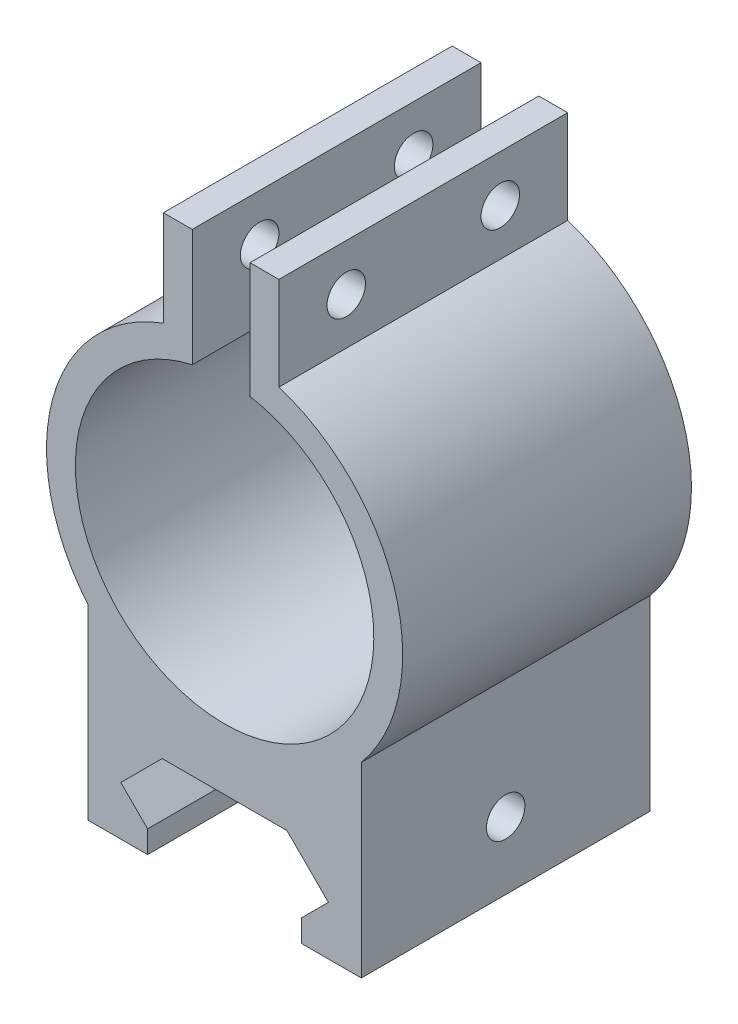
ISO-10303-21;
HEADER;
FILE_DESCRIPTION(('STEP AP214'),'2;1');
FILE_NAME('part.step','',(''),(''),'','','');
FILE_SCHEMA(('AUTOMOTIVE_DESIGN { 1 0 10303 214 1 1 1 1 }'));
ENDSEC;
DATA;
#1=APPLICATION_CONTEXT('core data for automotive mechanical design processes');
#2=APPLICATION_PROTOCOL_DEFINITION('international standard','automotive_design',2000,#1);
#3=PRODUCT_CONTEXT('',#1,'mechanical');
#4=PRODUCT('Part','Part','',(#3));
#5=PRODUCT_RELATED_PRODUCT_CATEGORY('part','',(#4));
#6=PRODUCT_DEFINITION_FORMATION('','',#4);
#7=PRODUCT_DEFINITION_CONTEXT('part definition',#1,'design');
#8=PRODUCT_DEFINITION('design','',#6,#7);
#9=PRODUCT_DEFINITION_SHAPE('','',#8);
#10=(LENGTH_UNIT() NAMED_UNIT(*) SI_UNIT(.MILLI.,.METRE.));
#11=(NAMED_UNIT(*) PLANE_ANGLE_UNIT() SI_UNIT($,.RADIAN.));
#12=(NAMED_UNIT(*) SI_UNIT($,.STERADIAN.) SOLID_ANGLE_UNIT());
#13=UNCERTAINTY_MEASURE_WITH_UNIT(LENGTH_MEASURE(1.E-05),#10,'distance_accuracy_value','');
#14=(GEOMETRIC_REPRESENTATION_CONTEXT(3) GLOBAL_UNCERTAINTY_ASSIGNED_CONTEXT((#13)) GLOBAL_UNIT_ASSIGNED_CONTEXT((#10,
#11,#12)) REPRESENTATION_CONTEXT('',''));
#15=CARTESIAN_POINT('',(0.,0.,0.));
#16=DIRECTION('',(0.,0.,1.));
#17=DIRECTION('',(1.,0.,0.));
#18=AXIS2_PLACEMENT_3D('',#15,#16,#17);
#19=CARTESIAN_POINT('',(-3.35941272408374,61.069189213308,30.));
#20=DIRECTION('',(0.,-1.,0.));
#21=DIRECTION('',(0.,0.,-1.));
#22=AXIS2_PLACEMENT_3D('',#19,#20,#21);
#23=PLANE('',#22);
#24=DIRECTION('',(-1.,0.,0.));
#25=VECTOR('',#24,1.);
#26=CARTESIAN_POINT('',(-3.35941272408374,61.069189213308,0.));
#27=LINE('',#26,#25);
#28=CARTESIAN_POINT('',(-3.35941272408374,61.069189213308,0.));
#29=VERTEX_POINT('',#28);
#30=CARTESIAN_POINT('',(-6.35941272408374,61.069189213308,0.));
#31=VERTEX_POINT('',#30);
#32=EDGE_CURVE('E255',#29,#31,#27,.T.);
#33=ORIENTED_EDGE('',*,*,#32,.T.);
#34=DIRECTION('',(0.,0.,-1.));
#35=VECTOR('',#34,1.);
#36=CARTESIAN_POINT('',(-6.35941272408374,61.069189213308,30.));
#37=LINE('',#36,#35);
#38=CARTESIAN_POINT('',(-6.35941272408374,61.069189213308,30.));
#39=VERTEX_POINT('',#38);
#40=EDGE_CURVE('E44',#39,#31,#37,.T.);
#41=ORIENTED_EDGE('',*,*,#40,.F.);
#42=DIRECTION('',(-1.,0.,0.));
#43=VECTOR('',#42,1.);
#44=CARTESIAN_POINT('',(-3.35941272408374,61.069189213308,30.));
#45=LINE('',#44,#43);
#46=CARTESIAN_POINT('',(-3.35941272408374,61.069189213308,30.));
#47=VERTEX_POINT('',#46);
#48=EDGE_CURVE('E259',#47,#39,#45,.T.);
#49=ORIENTED_EDGE('',*,*,#48,.F.);
#50=DIRECTION('',(0.,0.,-1.));
#51=VECTOR('',#50,1.);
#52=CARTESIAN_POINT('',(-3.35941272408374,61.069189213308,30.));
#53=LINE('',#52,#51);
#54=EDGE_CURVE('E11',#47,#29,#53,.T.);
#55=ORIENTED_EDGE('',*,*,#54,.T.);
#56=EDGE_LOOP('',(#33,#41,#49,#55));
#57=FACE_BOUND('',#56,.T.);
#58=ADVANCED_FACE('F36',(#57),#23,.F.);
#59=CARTESIAN_POINT('',(-6.35941272408374,61.069189213308,30.));
#60=DIRECTION('',(1.,0.,0.));
#61=DIRECTION('',(0.,1.,0.));
#62=AXIS2_PLACEMENT_3D('',#59,#60,#61);
#63=PLANE('',#62);
#64=CARTESIAN_POINT('',(-6.35941272408374,56.224474587412,23.));
#65=DIRECTION('',(1.,0.,0.));
#66=DIRECTION('',(0.,1.,0.));
#67=AXIS2_PLACEMENT_3D('',#64,#65,#66);
#68=CIRCLE('',#67,2.00000000000001);
#69=CARTESIAN_POINT('',(-6.35941272408374,58.224474587412,23.));
#70=VERTEX_POINT('',#69);
#71=EDGE_CURVE('E244',#70,#70,#68,.T.);
#72=ORIENTED_EDGE('',*,*,#71,.T.);
#73=EDGE_LOOP('',(#72));
#74=FACE_BOUND('',#73,.T.);
#75=CARTESIAN_POINT('',(-6.35941272408374,56.224474587412,7.));
#76=DIRECTION('',(1.,0.,0.));
#77=DIRECTION('',(0.,1.,0.));
#78=AXIS2_PLACEMENT_3D('',#75,#76,#77);
#79=CIRCLE('',#78,2.);
#80=CARTESIAN_POINT('',(-6.35941272408374,58.224474587412,7.));
#81=VERTEX_POINT('',#80);
#82=EDGE_CURVE('E241',#81,#81,#79,.T.);
#83=ORIENTED_EDGE('',*,*,#82,.T.);
#84=EDGE_LOOP('',(#83));
#85=FACE_BOUND('',#84,.T.);
#86=DIRECTION('',(0.,-1.,0.));
#87=VECTOR('',#86,1.);
#88=CARTESIAN_POINT('',(-6.35941272408374,61.069189213308,0.));
#89=LINE('',#88,#87);
#90=CARTESIAN_POINT('',(-6.35941272408374,51.1305271455411,0.));
#91=VERTEX_POINT('',#90);
#92=EDGE_CURVE('E300',#31,#91,#89,.T.);
#93=ORIENTED_EDGE('',*,*,#92,.T.);
#94=DIRECTION('',(0.,0.,-1.));
#95=VECTOR('',#94,1.);
#96=CARTESIAN_POINT('',(-6.35941272408374,51.1305271455411,30.));
#97=LINE('',#96,#95);
#98=CARTESIAN_POINT('',(-6.35941272408374,51.1305271455411,30.));
#99=VERTEX_POINT('',#98);
#100=EDGE_CURVE('E230',#99,#91,#97,.T.);
#101=ORIENTED_EDGE('',*,*,#100,.F.);
#102=DIRECTION('',(0.,-1.,0.));
#103=VECTOR('',#102,1.);
#104=CARTESIAN_POINT('',(-6.35941272408374,61.069189213308,30.));
#105=LINE('',#104,#103);
#106=EDGE_CURVE('E262',#39,#99,#105,.T.);
#107=ORIENTED_EDGE('',*,*,#106,.F.);
#108=ORIENTED_EDGE('',*,*,#40,.T.);
#109=EDGE_LOOP('',(#93,#101,#107,#108));
#110=FACE_BOUND('',#109,.T.);
#111=ADVANCED_FACE('F425',(#74,#85,#110),#63,.F.);
#112=CARTESIAN_POINT('',(0.,33.757908753233,30.));
#113=DIRECTION('',(0.,0.,-1.));
#114=DIRECTION('',(-1.,0.,0.));
#115=AXIS2_PLACEMENT_3D('',#112,#113,#114);
#116=CYLINDRICAL_SURFACE('',#115,18.5);
#117=CARTESIAN_POINT('',(0.,33.757908753233,0.));
#118=DIRECTION('',(0.,0.,1.));
#119=DIRECTION('',(1.,0.,0.));
#120=AXIS2_PLACEMENT_3D('',#117,#118,#119);
#121=CIRCLE('',#120,18.5);
#122=CARTESIAN_POINT('',(-14.2,21.9,0.));
#123=VERTEX_POINT('',#122);
#124=EDGE_CURVE('E302',#91,#123,#121,.T.);
#125=ORIENTED_EDGE('',*,*,#124,.T.);
#126=DIRECTION('',(0.,0.,-1.));
#127=VECTOR('',#126,1.);
#128=CARTESIAN_POINT('',(-14.2,21.9,30.));
#129=LINE('',#128,#127);
#130=CARTESIAN_POINT('',(-14.2,21.9,30.));
#131=VERTEX_POINT('',#130);
#132=EDGE_CURVE('E227',#131,#123,#129,.T.);
#133=ORIENTED_EDGE('',*,*,#132,.F.);
#134=CARTESIAN_POINT('',(0.,33.757908753233,30.));
#135=DIRECTION('',(0.,0.,1.));
#136=DIRECTION('',(1.,0.,0.));
#137=AXIS2_PLACEMENT_3D('',#134,#135,#136);
#138=CIRCLE('',#137,18.5);
#139=EDGE_CURVE('E264',#99,#131,#138,.T.);
#140=ORIENTED_EDGE('',*,*,#139,.F.);
#141=ORIENTED_EDGE('',*,*,#100,.T.);
#142=EDGE_LOOP('',(#125,#133,#140,#141));
#143=FACE_BOUND('',#142,.T.);
#144=ADVANCED_FACE('F420',(#143),#116,.T.);
#145=CARTESIAN_POINT('',(-14.2,2.5,30.));
#146=DIRECTION('',(1.,0.,0.));
#147=DIRECTION('',(0.,0.,-1.));
#148=AXIS2_PLACEMENT_3D('',#145,#146,#147);
#149=PLANE('',#148);
#150=CARTESIAN_POINT('',(-14.2,9.5,15.));
#151=DIRECTION('',(1.,0.,0.));
#152=DIRECTION('',(0.,0.,-1.));
#153=AXIS2_PLACEMENT_3D('',#150,#151,#152);
#154=CIRCLE('',#153,2.);
#155=CARTESIAN_POINT('',(-14.2,9.5,13.));
#156=VERTEX_POINT('',#155);
#157=EDGE_CURVE('E712',#156,#156,#154,.T.);
#158=ORIENTED_EDGE('',*,*,#157,.T.);
#159=EDGE_LOOP('',(#158));
#160=FACE_BOUND('',#159,.T.);
#161=DIRECTION('',(0.,-1.,0.));
#162=VECTOR('',#161,1.);
#163=CARTESIAN_POINT('',(-14.2,2.5,0.));
#164=LINE('',#163,#162);
#165=CARTESIAN_POINT('',(-14.2,2.5,0.));
#166=VERTEX_POINT('',#165);
#167=EDGE_CURVE('E304',#123,#166,#164,.T.);
#168=ORIENTED_EDGE('',*,*,#167,.T.);
#169=DIRECTION('',(0.,0.,-1.));
#170=VECTOR('',#169,1.);
#171=CARTESIAN_POINT('',(-14.2,2.5,30.));
#172=LINE('',#171,#170);
#173=CARTESIAN_POINT('',(-14.2,2.5,30.));
#174=VERTEX_POINT('',#173);
#175=EDGE_CURVE('E224',#174,#166,#172,.T.);
#176=ORIENTED_EDGE('',*,*,#175,.F.);
#177=DIRECTION('',(0.,-1.,0.));
#178=VECTOR('',#177,1.);
#179=CARTESIAN_POINT('',(-14.2,2.5,30.));
#180=LINE('',#179,#178);
#181=EDGE_CURVE('E266',#131,#174,#180,.T.);
#182=ORIENTED_EDGE('',*,*,#181,.F.);
#183=ORIENTED_EDGE('',*,*,#132,.T.);
#184=EDGE_LOOP('',(#168,#176,#182,#183));
#185=FACE_BOUND('',#184,.T.);
#186=ADVANCED_FACE('F415',(#160,#185),#149,.F.);
#187=CARTESIAN_POINT('',(-8.,2.5,30.));
#188=DIRECTION('',(0.,1.,0.));
#189=DIRECTION('',(0.,0.,1.));
#190=AXIS2_PLACEMENT_3D('',#187,#188,#189);
#191=PLANE('',#190);
#192=DIRECTION('',(1.,0.,0.));
#193=VECTOR('',#192,1.);
#194=CARTESIAN_POINT('',(-8.,2.5,0.));
#195=LINE('',#194,#193);
#196=CARTESIAN_POINT('',(-8.,2.5,0.));
#197=VERTEX_POINT('',#196);
#198=EDGE_CURVE('E307',#166,#197,#195,.T.);
#199=ORIENTED_EDGE('',*,*,#198,.T.);
#200=DIRECTION('',(0.,0.,-1.));
#201=VECTOR('',#200,1.);
#202=CARTESIAN_POINT('',(-8.,2.5,30.));
#203=LINE('',#202,#201);
#204=CARTESIAN_POINT('',(-8.,2.5,30.));
#205=VERTEX_POINT('',#204);
#206=EDGE_CURVE('E221',#205,#197,#203,.T.);
#207=ORIENTED_EDGE('',*,*,#206,.F.);
#208=DIRECTION('',(1.,0.,0.));
#209=VECTOR('',#208,1.);
#210=CARTESIAN_POINT('',(-11.0828427124747,2.5,30.));
#211=LINE('',#210,#209);
#212=EDGE_CURVE('E268',#174,#205,#211,.T.);
#213=ORIENTED_EDGE('',*,*,#212,.F.);
#214=ORIENTED_EDGE('',*,*,#175,.T.);
#215=EDGE_LOOP('',(#199,#207,#213,#214));
#216=FACE_BOUND('',#215,.T.);
#217=ADVANCED_FACE('F411',(#216),#191,.F.);
#218=CARTESIAN_POINT('',(-8.,4.81715728752538,30.));
#219=DIRECTION('',(-1.,0.,0.));
#220=DIRECTION('',(0.,0.,1.));
#221=AXIS2_PLACEMENT_3D('',#218,#219,#220);
#222=PLANE('',#221);
#223=DIRECTION('',(0.,1.,0.));
#224=VECTOR('',#223,1.);
#225=CARTESIAN_POINT('',(-8.,4.81715728752538,0.));
#226=LINE('',#225,#224);
#227=CARTESIAN_POINT('',(-8.,4.81715728752538,0.));
#228=VERTEX_POINT('',#227);
#229=EDGE_CURVE('E309',#197,#228,#226,.T.);
#230=ORIENTED_EDGE('',*,*,#229,.T.);
#231=DIRECTION('',(0.,0.,-1.));
#232=VECTOR('',#231,1.);
#233=CARTESIAN_POINT('',(-8.,4.81715728752538,30.));
#234=LINE('',#233,#232);
#235=CARTESIAN_POINT('',(-8.,4.81715728752538,30.));
#236=VERTEX_POINT('',#235);
#237=EDGE_CURVE('E218',#236,#228,#234,.T.);
#238=ORIENTED_EDGE('',*,*,#237,.F.);
#239=DIRECTION('',(0.,1.,0.));
#240=VECTOR('',#239,1.);
#241=CARTESIAN_POINT('',(-8.,4.81715728752538,30.));
#242=LINE('',#241,#240);
#243=EDGE_CURVE('E270',#205,#236,#242,.T.);
#244=ORIENTED_EDGE('',*,*,#243,.F.);
#245=ORIENTED_EDGE('',*,*,#206,.T.);
#246=EDGE_LOOP('',(#230,#238,#244,#245));
#247=FACE_BOUND('',#246,.T.);
#248=ADVANCED_FACE('F406',(#247),#222,.F.);
#249=CARTESIAN_POINT('',(-10.7828427124746,7.6,30.));
#250=DIRECTION('',(-0.707106781186547,-0.707106781186548,0.));
#251=DIRECTION('',(0.707106781186548,-0.707106781186547,0.));
#252=AXIS2_PLACEMENT_3D('',#249,#250,#251);
#253=PLANE('',#252);
#254=DIRECTION('',(0.,0.,-1.));
#255=VECTOR('',#254,1.);
#256=CARTESIAN_POINT('',(-10.7828427124746,7.6,30.));
#257=LINE('',#256,#255);
#258=CARTESIAN_POINT('',(-10.7828427124746,7.6,14.3755002001602));
#259=VERTEX_POINT('',#258);
#260=CARTESIAN_POINT('',(-10.7828427124746,7.6,0.));
#261=VERTEX_POINT('',#260);
#262=EDGE_CURVE('E214',#259,#261,#257,.T.);
#263=ORIENTED_EDGE('',*,*,#262,.F.);
#264=CARTESIAN_POINT('',(-12.6828427124746,9.5,15.));
#265=DIRECTION('',(-0.707106781186547,-0.707106781186548,0.));
#266=DIRECTION('',(0.707106781186548,-0.707106781186547,0.));
#267=AXIS2_PLACEMENT_3D('',#264,#265,#266);
#268=ELLIPSE('',#267,2.82842712474619,2.);
#269=CARTESIAN_POINT('',(-10.7828427124746,7.6,15.6244997998399));
#270=VERTEX_POINT('',#269);
#271=EDGE_CURVE('E51',#259,#270,#268,.T.);
#272=ORIENTED_EDGE('',*,*,#271,.T.);
#273=CARTESIAN_POINT('',(-10.7828427124746,7.6,30.));
#274=VERTEX_POINT('',#273);
#275=EDGE_CURVE('E215',#274,#270,#257,.T.);
#276=ORIENTED_EDGE('',*,*,#275,.F.);
#277=DIRECTION('',(-0.707106781186548,0.707106781186547,0.));
#278=VECTOR('',#277,1.);
#279=CARTESIAN_POINT('',(-10.7828427124746,7.6,30.));
#280=LINE('',#279,#278);
#281=EDGE_CURVE('E272',#236,#274,#280,.T.);
#282=ORIENTED_EDGE('',*,*,#281,.F.);
#283=ORIENTED_EDGE('',*,*,#237,.T.);
#284=DIRECTION('',(-0.707106781186548,0.707106781186547,0.));
#285=VECTOR('',#284,1.);
#286=CARTESIAN_POINT('',(-10.7828427124746,7.6,0.));
#287=LINE('',#286,#285);
#288=EDGE_CURVE('E311',#228,#261,#287,.T.);
#289=ORIENTED_EDGE('',*,*,#288,.T.);
#290=EDGE_LOOP('',(#263,#272,#276,#282,#283,#289));
#291=FACE_BOUND('',#290,.T.);
#292=ADVANCED_FACE('F400',(#291),#253,.F.);
#293=CARTESIAN_POINT('',(-6.48284271247462,11.9,30.));
#294=DIRECTION('',(-0.707106781186547,0.707106781186547,0.));
#295=DIRECTION('',(-0.707106781186548,-0.707106781186548,0.));
#296=AXIS2_PLACEMENT_3D('',#293,#294,#295);
#297=PLANE('',#296);
#298=ORIENTED_EDGE('',*,*,#275,.T.);
#299=CARTESIAN_POINT('',(-8.88284271247462,9.5,15.));
#300=DIRECTION('',(-0.707106781186547,0.707106781186547,0.));
#301=DIRECTION('',(0.707106781186548,0.707106781186548,0.));
#302=AXIS2_PLACEMENT_3D('',#299,#300,#301);
#303=ELLIPSE('',#302,2.82842712474619,2.);
#304=EDGE_CURVE('E198',#270,#259,#303,.T.);
#305=ORIENTED_EDGE('',*,*,#304,.T.);
#306=ORIENTED_EDGE('',*,*,#262,.T.);
#307=DIRECTION('',(0.707106781186548,0.707106781186548,0.));
#308=VECTOR('',#307,1.);
#309=CARTESIAN_POINT('',(-6.48284271247462,11.9,0.));
#310=LINE('',#309,#308);
#311=CARTESIAN_POINT('',(-6.48284271247462,11.9,0.));
#312=VERTEX_POINT('',#311);
#313=EDGE_CURVE('E314',#261,#312,#310,.T.);
#314=ORIENTED_EDGE('',*,*,#313,.T.);
#315=DIRECTION('',(0.,0.,-1.));
#316=VECTOR('',#315,1.);
#317=CARTESIAN_POINT('',(-6.48284271247462,11.9,30.));
#318=LINE('',#317,#316);
#319=CARTESIAN_POINT('',(-6.48284271247462,11.9,30.));
#320=VERTEX_POINT('',#319);
#321=EDGE_CURVE('E206',#320,#312,#318,.T.);
#322=ORIENTED_EDGE('',*,*,#321,.F.);
#323=DIRECTION('',(0.707106781186548,0.707106781186548,0.));
#324=VECTOR('',#323,1.);
#325=CARTESIAN_POINT('',(-6.48284271247462,11.9,30.));
#326=LINE('',#325,#324);
#327=EDGE_CURVE('E274',#274,#320,#326,.T.);
#328=ORIENTED_EDGE('',*,*,#327,.F.);
#329=EDGE_LOOP('',(#298,#305,#306,#314,#322,#328));
#330=FACE_BOUND('',#329,.T.);
#331=ADVANCED_FACE('F397',(#330),#297,.F.);
#332=CARTESIAN_POINT('',(6.48284271247462,11.9,30.));
#333=DIRECTION('',(0.,1.,0.));
#334=DIRECTION('',(0.,0.,1.));
#335=AXIS2_PLACEMENT_3D('',#332,#333,#334);
#336=PLANE('',#335);
#337=DIRECTION('',(1.,0.,0.));
#338=VECTOR('',#337,1.);
#339=CARTESIAN_POINT('',(6.48284271247462,11.9,0.));
#340=LINE('',#339,#338);
#341=CARTESIAN_POINT('',(6.48284271247462,11.9,0.));
#342=VERTEX_POINT('',#341);
#343=EDGE_CURVE('E316',#312,#342,#340,.T.);
#344=ORIENTED_EDGE('',*,*,#343,.T.);
#345=DIRECTION('',(0.,0.,-1.));
#346=VECTOR('',#345,1.);
#347=CARTESIAN_POINT('',(6.48284271247462,11.9,30.));
#348=LINE('',#347,#346);
#349=CARTESIAN_POINT('',(6.48284271247462,11.9,30.));
#350=VERTEX_POINT('',#349);
#351=EDGE_CURVE('E203',#350,#342,#348,.T.);
#352=ORIENTED_EDGE('',*,*,#351,.F.);
#353=DIRECTION('',(1.,0.,0.));
#354=VECTOR('',#353,1.);
#355=CARTESIAN_POINT('',(6.48284271247462,11.9,30.));
#356=LINE('',#355,#354);
#357=EDGE_CURVE('E276',#320,#350,#356,.T.);
#358=ORIENTED_EDGE('',*,*,#357,.F.);
#359=ORIENTED_EDGE('',*,*,#321,.T.);
#360=EDGE_LOOP('',(#344,#352,#358,#359));
#361=FACE_BOUND('',#360,.T.);
#362=ADVANCED_FACE('F393',(#361),#336,.F.);
#363=CARTESIAN_POINT('',(10.7828427124746,7.6,30.));
#364=DIRECTION('',(0.707106781186547,0.707106781186547,0.));
#365=DIRECTION('',(-0.707106781186548,0.707106781186548,0.));
#366=AXIS2_PLACEMENT_3D('',#363,#364,#365);
#367=PLANE('',#366);
#368=DIRECTION('',(0.,0.,-1.));
#369=VECTOR('',#368,1.);
#370=CARTESIAN_POINT('',(10.7828427124746,7.6,30.));
#371=LINE('',#370,#369);
#372=CARTESIAN_POINT('',(10.7828427124746,7.6,14.3755002001602));
#373=VERTEX_POINT('',#372);
#374=CARTESIAN_POINT('',(10.7828427124746,7.6,0.));
#375=VERTEX_POINT('',#374);
#376=EDGE_CURVE('E197',#373,#375,#371,.T.);
#377=ORIENTED_EDGE('',*,*,#376,.F.);
#378=CARTESIAN_POINT('',(8.88284271247462,9.5,15.));
#379=DIRECTION('',(0.707106781186547,0.707106781186547,0.));
#380=DIRECTION('',(0.707106781186548,-0.707106781186548,0.));
#381=AXIS2_PLACEMENT_3D('',#378,#379,#380);
#382=ELLIPSE('',#381,2.82842712474619,2.);
#383=CARTESIAN_POINT('',(10.7828427124746,7.6,15.6244997998398));
#384=VERTEX_POINT('',#383);
#385=EDGE_CURVE('E58',#373,#384,#382,.T.);
#386=ORIENTED_EDGE('',*,*,#385,.T.);
#387=CARTESIAN_POINT('',(10.7828427124746,7.6,30.));
#388=VERTEX_POINT('',#387);
#389=EDGE_CURVE('E194',#388,#384,#371,.T.);
#390=ORIENTED_EDGE('',*,*,#389,.F.);
#391=DIRECTION('',(0.707106781186547,-0.707106781186547,0.));
#392=VECTOR('',#391,1.);
#393=CARTESIAN_POINT('',(10.7828427124746,7.6,30.));
#394=LINE('',#393,#392);
#395=EDGE_CURVE('E278',#350,#388,#394,.T.);
#396=ORIENTED_EDGE('',*,*,#395,.F.);
#397=ORIENTED_EDGE('',*,*,#351,.T.);
#398=DIRECTION('',(0.707106781186547,-0.707106781186547,0.));
#399=VECTOR('',#398,1.);
#400=CARTESIAN_POINT('',(10.7828427124746,7.6,0.));
#401=LINE('',#400,#399);
#402=EDGE_CURVE('E318',#342,#375,#401,.T.);
#403=ORIENTED_EDGE('',*,*,#402,.T.);
#404=EDGE_LOOP('',(#377,#386,#390,#396,#397,#403));
#405=FACE_BOUND('',#404,.T.);
#406=ADVANCED_FACE('F192',(#405),#367,.F.);
#407=CARTESIAN_POINT('',(8.,4.81715728752538,30.));
#408=DIRECTION('',(0.707106781186547,-0.707106781186547,0.));
#409=DIRECTION('',(0.707106781186548,0.707106781186548,0.));
#410=AXIS2_PLACEMENT_3D('',#407,#408,#409);
#411=PLANE('',#410);
#412=ORIENTED_EDGE('',*,*,#389,.T.);
#413=CARTESIAN_POINT('',(12.6828427124746,9.5,15.));
#414=DIRECTION('',(0.707106781186547,-0.707106781186547,0.));
#415=DIRECTION('',(0.707106781186548,0.707106781186548,0.));
#416=AXIS2_PLACEMENT_3D('',#413,#414,#415);
#417=ELLIPSE('',#416,2.82842712474619,2.);
#418=EDGE_CURVE('E183',#384,#373,#417,.T.);
#419=ORIENTED_EDGE('',*,*,#418,.T.);
#420=ORIENTED_EDGE('',*,*,#376,.T.);
#421=DIRECTION('',(-0.707106781186548,-0.707106781186548,0.));
#422=VECTOR('',#421,1.);
#423=CARTESIAN_POINT('',(8.,4.81715728752538,0.));
#424=LINE('',#423,#422);
#425=CARTESIAN_POINT('',(8.,4.81715728752538,0.));
#426=VERTEX_POINT('',#425);
#427=EDGE_CURVE('E320',#375,#426,#424,.T.);
#428=ORIENTED_EDGE('',*,*,#427,.T.);
#429=DIRECTION('',(0.,0.,-1.));
#430=VECTOR('',#429,1.);
#431=CARTESIAN_POINT('',(8.,4.81715728752538,30.));
#432=LINE('',#431,#430);
#433=CARTESIAN_POINT('',(8.,4.81715728752538,30.));
#434=VERTEX_POINT('',#433);
#435=EDGE_CURVE('E208',#434,#426,#432,.T.);
#436=ORIENTED_EDGE('',*,*,#435,.F.);
#437=DIRECTION('',(-0.707106781186548,-0.707106781186548,0.));
#438=VECTOR('',#437,1.);
#439=CARTESIAN_POINT('',(8.,4.81715728752538,30.));
#440=LINE('',#439,#438);
#441=EDGE_CURVE('E202',#388,#434,#440,.T.);
#442=ORIENTED_EDGE('',*,*,#441,.F.);
#443=EDGE_LOOP('',(#412,#419,#420,#428,#436,#442));
#444=FACE_BOUND('',#443,.T.);
#445=ADVANCED_FACE('F200',(#444),#411,.F.);
#446=CARTESIAN_POINT('',(8.,2.5,30.));
#447=DIRECTION('',(1.,0.,0.));
#448=DIRECTION('',(0.,0.,-1.));
#449=AXIS2_PLACEMENT_3D('',#446,#447,#448);
#450=PLANE('',#449);
#451=DIRECTION('',(0.,-1.,0.));
#452=VECTOR('',#451,1.);
#453=CARTESIAN_POINT('',(8.,2.5,0.));
#454=LINE('',#453,#452);
#455=CARTESIAN_POINT('',(8.,2.5,0.));
#456=VERTEX_POINT('',#455);
#457=EDGE_CURVE('E322',#426,#456,#454,.T.);
#458=ORIENTED_EDGE('',*,*,#457,.T.);
#459=DIRECTION('',(0.,0.,-1.));
#460=VECTOR('',#459,1.);
#461=CARTESIAN_POINT('',(8.,2.5,30.));
#462=LINE('',#461,#460);
#463=CARTESIAN_POINT('',(8.,2.5,30.));
#464=VERTEX_POINT('',#463);
#465=EDGE_CURVE('E360',#464,#456,#462,.T.);
#466=ORIENTED_EDGE('',*,*,#465,.F.);
#467=DIRECTION('',(0.,-1.,0.));
#468=VECTOR('',#467,1.);
#469=CARTESIAN_POINT('',(8.,2.5,30.));
#470=LINE('',#469,#468);
#471=EDGE_CURVE('E281',#434,#464,#470,.T.);
#472=ORIENTED_EDGE('',*,*,#471,.F.);
#473=ORIENTED_EDGE('',*,*,#435,.T.);
#474=EDGE_LOOP('',(#458,#466,#472,#473));
#475=FACE_BOUND('',#474,.T.);
#476=ADVANCED_FACE('F369',(#475),#450,.F.);
#477=CARTESIAN_POINT('',(11.0828427124746,2.5,30.));
#478=DIRECTION('',(0.,1.,0.));
#479=DIRECTION('',(0.,0.,1.));
#480=AXIS2_PLACEMENT_3D('',#477,#478,#479);
#481=PLANE('',#480);
#482=DIRECTION('',(1.,0.,0.));
#483=VECTOR('',#482,1.);
#484=CARTESIAN_POINT('',(11.0828427124746,2.5,0.));
#485=LINE('',#484,#483);
#486=CARTESIAN_POINT('',(14.2,2.5,0.));
#487=VERTEX_POINT('',#486);
#488=EDGE_CURVE('E325',#456,#487,#485,.T.);
#489=ORIENTED_EDGE('',*,*,#488,.T.);
#490=DIRECTION('',(0.,0.,-1.));
#491=VECTOR('',#490,1.);
#492=CARTESIAN_POINT('',(14.2,2.5,30.));
#493=LINE('',#492,#491);
#494=CARTESIAN_POINT('',(14.2,2.5,30.));
#495=VERTEX_POINT('',#494);
#496=EDGE_CURVE('E358',#495,#487,#493,.T.);
#497=ORIENTED_EDGE('',*,*,#496,.F.);
#498=DIRECTION('',(1.,0.,0.));
#499=VECTOR('',#498,1.);
#500=CARTESIAN_POINT('',(11.0828427124746,2.5,30.));
#501=LINE('',#500,#499);
#502=EDGE_CURVE('E283',#464,#495,#501,.T.);
#503=ORIENTED_EDGE('',*,*,#502,.F.);
#504=ORIENTED_EDGE('',*,*,#465,.T.);
#505=EDGE_LOOP('',(#489,#497,#503,#504));
#506=FACE_BOUND('',#505,.T.);
#507=ADVANCED_FACE('F378',(#506),#481,.F.);
#508=CARTESIAN_POINT('',(14.2,2.5,30.));
#509=DIRECTION('',(-1.,0.,0.));
#510=DIRECTION('',(0.,-1.,0.));
#511=AXIS2_PLACEMENT_3D('',#508,#509,#510);
#512=PLANE('',#511);
#513=CARTESIAN_POINT('',(14.2,9.5,15.));
#514=DIRECTION('',(1.,0.,0.));
#515=DIRECTION('',(0.,1.,0.));
#516=AXIS2_PLACEMENT_3D('',#513,#514,#515);
#517=CIRCLE('',#516,2.);
#518=CARTESIAN_POINT('',(14.2,11.5,15.));
#519=VERTEX_POINT('',#518);
#520=EDGE_CURVE('E188',#519,#519,#517,.T.);
#521=ORIENTED_EDGE('',*,*,#520,.F.);
#522=EDGE_LOOP('',(#521));
#523=FACE_BOUND('',#522,.T.);
#524=DIRECTION('',(0.,1.,0.));
#525=VECTOR('',#524,1.);
#526=CARTESIAN_POINT('',(14.2,2.5,0.));
#527=LINE('',#526,#525);
#528=CARTESIAN_POINT('',(14.2,21.9,0.));
#529=VERTEX_POINT('',#528);
#530=EDGE_CURVE('E327',#487,#529,#527,.T.);
#531=ORIENTED_EDGE('',*,*,#530,.T.);
#532=DIRECTION('',(0.,0.,-1.));
#533=VECTOR('',#532,1.);
#534=CARTESIAN_POINT('',(14.2,21.9,30.));
#535=LINE('',#534,#533);
#536=CARTESIAN_POINT('',(14.2,21.9,30.));
#537=VERTEX_POINT('',#536);
#538=EDGE_CURVE('E355',#537,#529,#535,.T.);
#539=ORIENTED_EDGE('',*,*,#538,.F.);
#540=DIRECTION('',(0.,1.,0.));
#541=VECTOR('',#540,1.);
#542=CARTESIAN_POINT('',(14.2,2.5,30.));
#543=LINE('',#542,#541);
#544=EDGE_CURVE('E285',#495,#537,#543,.T.);
#545=ORIENTED_EDGE('',*,*,#544,.F.);
#546=ORIENTED_EDGE('',*,*,#496,.T.);
#547=EDGE_LOOP('',(#531,#539,#545,#546));
#548=FACE_BOUND('',#547,.T.);
#549=ADVANCED_FACE('F381',(#523,#548),#512,.F.);
#550=CARTESIAN_POINT('',(0.,33.757908753233,30.));
#551=DIRECTION('',(0.,0.,-1.));
#552=DIRECTION('',(-1.,0.,0.));
#553=AXIS2_PLACEMENT_3D('',#550,#551,#552);
#554=CYLINDRICAL_SURFACE('',#553,18.5);
#555=CARTESIAN_POINT('',(0.,33.757908753233,0.));
#556=DIRECTION('',(0.,0.,1.));
#557=DIRECTION('',(1.,0.,0.));
#558=AXIS2_PLACEMENT_3D('',#555,#556,#557);
#559=CIRCLE('',#558,18.5);
#560=CARTESIAN_POINT('',(5.64058727591626,51.3770396961249,0.));
#561=VERTEX_POINT('',#560);
#562=EDGE_CURVE('E329',#529,#561,#559,.T.);
#563=ORIENTED_EDGE('',*,*,#562,.T.);
#564=DIRECTION('',(0.,0.,-1.));
#565=VECTOR('',#564,1.);
#566=CARTESIAN_POINT('',(5.64058727591626,51.3770396961249,30.));
#567=LINE('',#566,#565);
#568=CARTESIAN_POINT('',(5.64058727591626,51.3770396961249,30.));
#569=VERTEX_POINT('',#568);
#570=EDGE_CURVE('E352',#569,#561,#567,.T.);
#571=ORIENTED_EDGE('',*,*,#570,.F.);
#572=CARTESIAN_POINT('',(0.,33.757908753233,30.));
#573=DIRECTION('',(0.,0.,1.));
#574=DIRECTION('',(1.,0.,0.));
#575=AXIS2_PLACEMENT_3D('',#572,#573,#574);
#576=CIRCLE('',#575,18.5);
#577=EDGE_CURVE('E287',#537,#569,#576,.T.);
#578=ORIENTED_EDGE('',*,*,#577,.F.);
#579=ORIENTED_EDGE('',*,*,#538,.T.);
#580=EDGE_LOOP('',(#563,#571,#578,#579));
#581=FACE_BOUND('',#580,.T.);
#582=ADVANCED_FACE('F452',(#581),#554,.T.);
#583=CARTESIAN_POINT('',(5.64058727591626,61.071909478699,30.));
#584=DIRECTION('',(-1.,0.,0.));
#585=DIRECTION('',(0.,-1.,0.));
#586=AXIS2_PLACEMENT_3D('',#583,#584,#585);
#587=PLANE('',#586);
#588=CARTESIAN_POINT('',(5.64058727591626,56.224474587412,23.));
#589=DIRECTION('',(1.,0.,0.));
#590=DIRECTION('',(0.,0.,-1.));
#591=AXIS2_PLACEMENT_3D('',#588,#589,#590);
#592=CIRCLE('',#591,2.00000000000001);
#593=CARTESIAN_POINT('',(5.64058727591626,56.224474587412,21.));
#594=VERTEX_POINT('',#593);
#595=EDGE_CURVE('E706',#594,#594,#592,.T.);
#596=ORIENTED_EDGE('',*,*,#595,.F.);
#597=EDGE_LOOP('',(#596));
#598=FACE_BOUND('',#597,.T.);
#599=CARTESIAN_POINT('',(5.64058727591626,56.224474587412,7.));
#600=DIRECTION('',(1.,0.,0.));
#601=DIRECTION('',(0.,0.,-1.));
#602=AXIS2_PLACEMENT_3D('',#599,#600,#601);
#603=CIRCLE('',#602,2.);
#604=CARTESIAN_POINT('',(5.64058727591626,56.224474587412,5.));
#605=VERTEX_POINT('',#604);
#606=EDGE_CURVE('E237',#605,#605,#603,.T.);
#607=ORIENTED_EDGE('',*,*,#606,.F.);
#608=EDGE_LOOP('',(#607));
#609=FACE_BOUND('',#608,.T.);
#610=DIRECTION('',(0.,1.,0.));
#611=VECTOR('',#610,1.);
#612=CARTESIAN_POINT('',(5.64058727591626,61.071909478699,0.));
#613=LINE('',#612,#611);
#614=CARTESIAN_POINT('',(5.64058727591626,61.071909478699,0.));
#615=VERTEX_POINT('',#614);
#616=EDGE_CURVE('E331',#561,#615,#613,.T.);
#617=ORIENTED_EDGE('',*,*,#616,.T.);
#618=DIRECTION('',(0.,0.,-1.));
#619=VECTOR('',#618,1.);
#620=CARTESIAN_POINT('',(5.64058727591626,61.071909478699,30.));
#621=LINE('',#620,#619);
#622=CARTESIAN_POINT('',(5.64058727591626,61.071909478699,30.));
#623=VERTEX_POINT('',#622);
#624=EDGE_CURVE('E349',#623,#615,#621,.T.);
#625=ORIENTED_EDGE('',*,*,#624,.F.);
#626=DIRECTION('',(0.,1.,0.));
#627=VECTOR('',#626,1.);
#628=CARTESIAN_POINT('',(5.64058727591626,61.071909478699,30.));
#629=LINE('',#628,#627);
#630=EDGE_CURVE('E289',#569,#623,#629,.T.);
#631=ORIENTED_EDGE('',*,*,#630,.F.);
#632=ORIENTED_EDGE('',*,*,#570,.T.);
#633=EDGE_LOOP('',(#617,#625,#631,#632));
#634=FACE_BOUND('',#633,.T.);
#635=ADVANCED_FACE('F450',(#598,#609,#634),#587,.F.);
#636=CARTESIAN_POINT('',(2.64058727591626,61.071909478699,30.));
#637=DIRECTION('',(0.,-1.,0.));
#638=DIRECTION('',(0.,0.,-1.));
#639=AXIS2_PLACEMENT_3D('',#636,#637,#638);
#640=PLANE('',#639);
#641=DIRECTION('',(-1.,0.,0.));
#642=VECTOR('',#641,1.);
#643=CARTESIAN_POINT('',(2.64058727591626,61.071909478699,0.));
#644=LINE('',#643,#642);
#645=CARTESIAN_POINT('',(2.64058727591626,61.071909478699,0.));
#646=VERTEX_POINT('',#645);
#647=EDGE_CURVE('E333',#615,#646,#644,.T.);
#648=ORIENTED_EDGE('',*,*,#647,.T.);
#649=DIRECTION('',(0.,0.,-1.));
#650=VECTOR('',#649,1.);
#651=CARTESIAN_POINT('',(2.64058727591626,61.071909478699,30.));
#652=LINE('',#651,#650);
#653=CARTESIAN_POINT('',(2.64058727591626,61.071909478699,30.));
#654=VERTEX_POINT('',#653);
#655=EDGE_CURVE('E346',#654,#646,#652,.T.);
#656=ORIENTED_EDGE('',*,*,#655,.F.);
#657=DIRECTION('',(-1.,0.,0.));
#658=VECTOR('',#657,1.);
#659=CARTESIAN_POINT('',(2.64058727591626,61.071909478699,30.));
#660=LINE('',#659,#658);
#661=EDGE_CURVE('E291',#623,#654,#660,.T.);
#662=ORIENTED_EDGE('',*,*,#661,.F.);
#663=ORIENTED_EDGE('',*,*,#624,.T.);
#664=EDGE_LOOP('',(#648,#656,#662,#663));
#665=FACE_BOUND('',#664,.T.);
#666=ADVANCED_FACE('F445',(#665),#640,.F.);
#667=CARTESIAN_POINT('',(2.64058727591626,55.0584785264655,30.));
#668=DIRECTION('',(1.,0.,0.));
#669=DIRECTION('',(0.,1.,0.));
#670=AXIS2_PLACEMENT_3D('',#667,#668,#669);
#671=PLANE('',#670);
#672=CARTESIAN_POINT('',(2.64058727591626,56.224474587412,23.));
#673=DIRECTION('',(1.,0.,0.));
#674=DIRECTION('',(0.,1.,0.));
#675=AXIS2_PLACEMENT_3D('',#672,#673,#674);
#676=CIRCLE('',#675,2.00000000000001);
#677=CARTESIAN_POINT('',(2.64058727591626,58.224474587412,23.));
#678=VERTEX_POINT('',#677);
#679=EDGE_CURVE('E249',#678,#678,#676,.T.);
#680=ORIENTED_EDGE('',*,*,#679,.T.);
#681=EDGE_LOOP('',(#680));
#682=FACE_BOUND('',#681,.T.);
#683=CARTESIAN_POINT('',(2.64058727591626,56.224474587412,7.));
#684=DIRECTION('',(1.,0.,0.));
#685=DIRECTION('',(0.,1.,0.));
#686=AXIS2_PLACEMENT_3D('',#683,#684,#685);
#687=CIRCLE('',#686,2.);
#688=CARTESIAN_POINT('',(2.64058727591626,58.224474587412,7.));
#689=VERTEX_POINT('',#688);
#690=EDGE_CURVE('E236',#689,#689,#687,.T.);
#691=ORIENTED_EDGE('',*,*,#690,.T.);
#692=EDGE_LOOP('',(#691));
#693=FACE_BOUND('',#692,.T.);
#694=DIRECTION('',(0.,-1.,0.));
#695=VECTOR('',#694,1.);
#696=CARTESIAN_POINT('',(2.64058727591626,55.0584785264655,0.));
#697=LINE('',#696,#695);
#698=CARTESIAN_POINT('',(2.64058727591626,49.0313268002279,0.));
#699=VERTEX_POINT('',#698);
#700=EDGE_CURVE('E336',#646,#699,#697,.T.);
#701=ORIENTED_EDGE('',*,*,#700,.T.);
#702=DIRECTION('',(0.,0.,-1.));
#703=VECTOR('',#702,1.);
#704=CARTESIAN_POINT('',(2.64058727591626,49.0313268002279,30.));
#705=LINE('',#704,#703);
#706=CARTESIAN_POINT('',(2.64058727591626,49.0313268002279,30.));
#707=VERTEX_POINT('',#706);
#708=EDGE_CURVE('E343',#707,#699,#705,.T.);
#709=ORIENTED_EDGE('',*,*,#708,.F.);
#710=DIRECTION('',(0.,-1.,0.));
#711=VECTOR('',#710,1.);
#712=CARTESIAN_POINT('',(2.64058727591626,55.0584785264655,30.));
#713=LINE('',#712,#711);
#714=EDGE_CURVE('E293',#654,#707,#713,.T.);
#715=ORIENTED_EDGE('',*,*,#714,.F.);
#716=ORIENTED_EDGE('',*,*,#655,.T.);
#717=EDGE_LOOP('',(#701,#709,#715,#716));
#718=FACE_BOUND('',#717,.T.);
#719=ADVANCED_FACE('F440',(#682,#693,#718),#671,.F.);
#720=CARTESIAN_POINT('',(0.,33.757908753233,30.));
#721=DIRECTION('',(0.,0.,-1.));
#722=DIRECTION('',(-1.,0.,0.));
#723=AXIS2_PLACEMENT_3D('',#720,#721,#722);
#724=CYLINDRICAL_SURFACE('',#723,15.5);
#725=CARTESIAN_POINT('',(0.,33.757908753233,0.));
#726=DIRECTION('',(0.,0.,-1.));
#727=DIRECTION('',(1.,0.,0.));
#728=AXIS2_PLACEMENT_3D('',#725,#726,#727);
#729=CIRCLE('',#728,15.5);
#730=CARTESIAN_POINT('',(-3.35941272408374,48.8894766214106,0.));
#731=VERTEX_POINT('',#730);
#732=EDGE_CURVE('E338',#699,#731,#729,.T.);
#733=ORIENTED_EDGE('',*,*,#732,.T.);
#734=DIRECTION('',(0.,0.,-1.));
#735=VECTOR('',#734,1.);
#736=CARTESIAN_POINT('',(-3.35941272408374,48.8894766214106,30.));
#737=LINE('',#736,#735);
#738=CARTESIAN_POINT('',(-3.35941272408374,48.8894766214106,30.));
#739=VERTEX_POINT('',#738);
#740=EDGE_CURVE('E298',#739,#731,#737,.T.);
#741=ORIENTED_EDGE('',*,*,#740,.F.);
#742=CARTESIAN_POINT('',(0.,33.757908753233,30.));
#743=DIRECTION('',(0.,0.,-1.));
#744=DIRECTION('',(1.,0.,0.));
#745=AXIS2_PLACEMENT_3D('',#742,#743,#744);
#746=CIRCLE('',#745,15.5);
#747=EDGE_CURVE('E295',#707,#739,#746,.T.);
#748=ORIENTED_EDGE('',*,*,#747,.F.);
#749=ORIENTED_EDGE('',*,*,#708,.T.);
#750=EDGE_LOOP('',(#733,#741,#748,#749));
#751=FACE_BOUND('',#750,.T.);
#752=ADVANCED_FACE('F436',(#751),#724,.F.);
#753=CARTESIAN_POINT('',(-3.35941272408374,55.069189213308,30.));
#754=DIRECTION('',(-1.,0.,0.));
#755=DIRECTION('',(0.,-1.,0.));
#756=AXIS2_PLACEMENT_3D('',#753,#754,#755);
#757=PLANE('',#756);
#758=CARTESIAN_POINT('',(-3.35941272408374,56.224474587412,23.));
#759=DIRECTION('',(-1.,0.,0.));
#760=DIRECTION('',(0.,-1.,0.));
#761=AXIS2_PLACEMENT_3D('',#758,#759,#760);
#762=CIRCLE('',#761,2.00000000000001);
#763=CARTESIAN_POINT('',(-3.35941272408374,54.2244745874119,23.));
#764=VERTEX_POINT('',#763);
#765=EDGE_CURVE('E39',#764,#764,#762,.T.);
#766=ORIENTED_EDGE('',*,*,#765,.T.);
#767=EDGE_LOOP('',(#766));
#768=FACE_BOUND('',#767,.T.);
#769=CARTESIAN_POINT('',(-3.35941272408374,56.224474587412,7.));
#770=DIRECTION('',(-1.,0.,0.));
#771=DIRECTION('',(0.,-1.,0.));
#772=AXIS2_PLACEMENT_3D('',#769,#770,#771);
#773=CIRCLE('',#772,2.);
#774=CARTESIAN_POINT('',(-3.35941272408374,54.224474587412,7.));
#775=VERTEX_POINT('',#774);
#776=EDGE_CURVE('E234',#775,#775,#773,.T.);
#777=ORIENTED_EDGE('',*,*,#776,.T.);
#778=EDGE_LOOP('',(#777));
#779=FACE_BOUND('',#778,.T.);
#780=DIRECTION('',(0.,1.,0.));
#781=VECTOR('',#780,1.);
#782=CARTESIAN_POINT('',(-3.35941272408374,55.069189213308,0.));
#783=LINE('',#782,#781);
#784=EDGE_CURVE('E260',#731,#29,#783,.T.);
#785=ORIENTED_EDGE('',*,*,#784,.T.);
#786=ORIENTED_EDGE('',*,*,#54,.F.);
#787=DIRECTION('',(0.,1.,0.));
#788=VECTOR('',#787,1.);
#789=CARTESIAN_POINT('',(-3.35941272408374,55.069189213308,30.));
#790=LINE('',#789,#788);
#791=EDGE_CURVE('E256',#739,#47,#790,.T.);
#792=ORIENTED_EDGE('',*,*,#791,.F.);
#793=ORIENTED_EDGE('',*,*,#740,.T.);
#794=EDGE_LOOP('',(#785,#786,#792,#793));
#795=FACE_BOUND('',#794,.T.);
#796=ADVANCED_FACE('F432',(#768,#779,#795),#757,.F.);
#797=CARTESIAN_POINT('',(0.,33.757908753233,30.));
#798=DIRECTION('',(0.,0.,1.));
#799=DIRECTION('',(1.,0.,0.));
#800=AXIS2_PLACEMENT_3D('',#797,#798,#799);
#801=PLANE('',#800);
#802=ORIENTED_EDGE('',*,*,#791,.T.);
#803=ORIENTED_EDGE('',*,*,#48,.T.);
#804=ORIENTED_EDGE('',*,*,#106,.T.);
#805=ORIENTED_EDGE('',*,*,#139,.T.);
#806=ORIENTED_EDGE('',*,*,#181,.T.);
#807=ORIENTED_EDGE('',*,*,#212,.T.);
#808=ORIENTED_EDGE('',*,*,#243,.T.);
#809=ORIENTED_EDGE('',*,*,#281,.T.);
#810=ORIENTED_EDGE('',*,*,#327,.T.);
#811=ORIENTED_EDGE('',*,*,#357,.T.);
#812=ORIENTED_EDGE('',*,*,#395,.T.);
#813=ORIENTED_EDGE('',*,*,#441,.T.);
#814=ORIENTED_EDGE('',*,*,#471,.T.);
#815=ORIENTED_EDGE('',*,*,#502,.T.);
#816=ORIENTED_EDGE('',*,*,#544,.T.);
#817=ORIENTED_EDGE('',*,*,#577,.T.);
#818=ORIENTED_EDGE('',*,*,#630,.T.);
#819=ORIENTED_EDGE('',*,*,#661,.T.);
#820=ORIENTED_EDGE('',*,*,#714,.T.);
#821=ORIENTED_EDGE('',*,*,#747,.T.);
#822=EDGE_LOOP('',(#802,#803,#804,#805,#806,#807,#808,#809,#810,#811,#812,#813,#814,#815,#816,
#817,#818,#819,#820,#821));
#823=FACE_BOUND('',#822,.T.);
#824=ADVANCED_FACE('F385',(#823),#801,.T.);
#825=CARTESIAN_POINT('',(0.,33.757908753233,0.));
#826=DIRECTION('',(0.,0.,1.));
#827=DIRECTION('',(1.,0.,0.));
#828=AXIS2_PLACEMENT_3D('',#825,#826,#827);
#829=PLANE('',#828);
#830=ORIENTED_EDGE('',*,*,#32,.F.);
#831=ORIENTED_EDGE('',*,*,#784,.F.);
#832=ORIENTED_EDGE('',*,*,#732,.F.);
#833=ORIENTED_EDGE('',*,*,#700,.F.);
#834=ORIENTED_EDGE('',*,*,#647,.F.);
#835=ORIENTED_EDGE('',*,*,#616,.F.);
#836=ORIENTED_EDGE('',*,*,#562,.F.);
#837=ORIENTED_EDGE('',*,*,#530,.F.);
#838=ORIENTED_EDGE('',*,*,#488,.F.);
#839=ORIENTED_EDGE('',*,*,#457,.F.);
#840=ORIENTED_EDGE('',*,*,#427,.F.);
#841=ORIENTED_EDGE('',*,*,#402,.F.);
#842=ORIENTED_EDGE('',*,*,#343,.F.);
#843=ORIENTED_EDGE('',*,*,#313,.F.);
#844=ORIENTED_EDGE('',*,*,#288,.F.);
#845=ORIENTED_EDGE('',*,*,#229,.F.);
#846=ORIENTED_EDGE('',*,*,#198,.F.);
#847=ORIENTED_EDGE('',*,*,#167,.F.);
#848=ORIENTED_EDGE('',*,*,#124,.F.);
#849=ORIENTED_EDGE('',*,*,#92,.F.);
#850=EDGE_LOOP('',(#830,#831,#832,#833,#834,#835,#836,#837,#838,#839,#840,#841,#842,#843,#844,
#845,#846,#847,#848,#849));
#851=FACE_BOUND('',#850,.T.);
#852=ADVANCED_FACE('F373',(#851),#829,.F.);
#853=CARTESIAN_POINT('',(-18.5,56.224474587412,7.));
#854=DIRECTION('',(1.,0.,0.));
#855=DIRECTION('',(0.,0.,-1.));
#856=AXIS2_PLACEMENT_3D('',#853,#854,#855);
#857=CYLINDRICAL_SURFACE('',#856,2.);
#858=ORIENTED_EDGE('',*,*,#776,.F.);
#859=EDGE_LOOP('',(#858));
#860=FACE_BOUND('',#859,.T.);
#861=ORIENTED_EDGE('',*,*,#82,.F.);
#862=EDGE_LOOP('',(#861));
#863=FACE_BOUND('',#862,.T.);
#864=ADVANCED_FACE('F538',(#860,#863),#857,.F.);
#865=ORIENTED_EDGE('',*,*,#606,.T.);
#866=EDGE_LOOP('',(#865));
#867=FACE_BOUND('',#866,.T.);
#868=ORIENTED_EDGE('',*,*,#690,.F.);
#869=EDGE_LOOP('',(#868));
#870=FACE_BOUND('',#869,.T.);
#871=ADVANCED_FACE('F536',(#867,#870),#857,.F.);
#872=CARTESIAN_POINT('',(-18.5,56.224474587412,23.));
#873=DIRECTION('',(1.,0.,0.));
#874=DIRECTION('',(0.,0.,-1.));
#875=AXIS2_PLACEMENT_3D('',#872,#873,#874);
#876=CYLINDRICAL_SURFACE('',#875,2.00000000000001);
#877=ORIENTED_EDGE('',*,*,#765,.F.);
#878=EDGE_LOOP('',(#877));
#879=FACE_BOUND('',#878,.T.);
#880=ORIENTED_EDGE('',*,*,#71,.F.);
#881=EDGE_LOOP('',(#880));
#882=FACE_BOUND('',#881,.T.);
#883=ADVANCED_FACE('F533',(#879,#882),#876,.F.);
#884=ORIENTED_EDGE('',*,*,#595,.T.);
#885=EDGE_LOOP('',(#884));
#886=FACE_BOUND('',#885,.T.);
#887=ORIENTED_EDGE('',*,*,#679,.F.);
#888=EDGE_LOOP('',(#887));
#889=FACE_BOUND('',#888,.T.);
#890=ADVANCED_FACE('F517',(#886,#889),#876,.F.);
#891=CARTESIAN_POINT('',(-18.5,9.5,15.));
#892=DIRECTION('',(1.,0.,0.));
#893=DIRECTION('',(0.,1.,0.));
#894=AXIS2_PLACEMENT_3D('',#891,#892,#893);
#895=CYLINDRICAL_SURFACE('',#894,2.);
#896=ORIENTED_EDGE('',*,*,#520,.T.);
#897=EDGE_LOOP('',(#896));
#898=FACE_BOUND('',#897,.T.);
#899=ORIENTED_EDGE('',*,*,#418,.F.);
#900=ORIENTED_EDGE('',*,*,#385,.F.);
#901=EDGE_LOOP('',(#899,#900));
#902=FACE_BOUND('',#901,.T.);
#903=ADVANCED_FACE('F184',(#898,#902),#895,.F.);
#904=ORIENTED_EDGE('',*,*,#304,.F.);
#905=ORIENTED_EDGE('',*,*,#271,.F.);
#906=EDGE_LOOP('',(#904,#905));
#907=FACE_BOUND('',#906,.T.);
#908=ORIENTED_EDGE('',*,*,#157,.F.);
#909=EDGE_LOOP('',(#908));
#910=FACE_BOUND('',#909,.T.);
#911=ADVANCED_FACE('F516',(#907,#910),#895,.F.);
#912=CLOSED_SHELL('',(#58,#111,#144,#186,#217,#248,#292,#331,#362,#406,#445,#476,#507,#549,#582,
#635,#666,#719,#752,#796,#824,#852,#864,#871,#883,#890,#903,#911));
#913=MANIFOLD_SOLID_BREP('B2',#912);
#914=ADVANCED_BREP_SHAPE_REPRESENTATION('',(#18,#913),#14);
#915=SHAPE_DEFINITION_REPRESENTATION(#9,#914);
ENDSEC;
END-ISO-10303-21;
